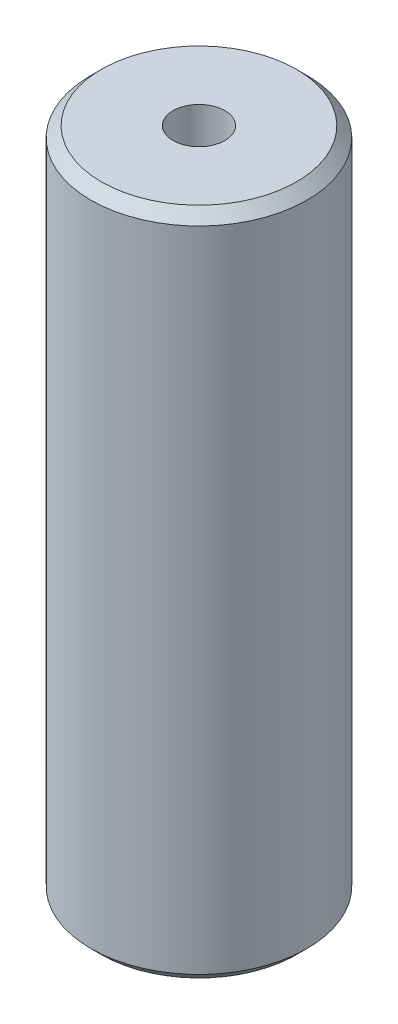
ISO-10303-21;
HEADER;
FILE_DESCRIPTION(('STEP AP214'),'2;1');
FILE_NAME('part.step','',(''),(''),'','','');
FILE_SCHEMA(('AUTOMOTIVE_DESIGN { 1 0 10303 214 1 1 1 1 }'));
ENDSEC;
DATA;
#1=APPLICATION_CONTEXT('core data for automotive mechanical design processes');
#2=APPLICATION_PROTOCOL_DEFINITION('international standard','automotive_design',2000,#1);
#3=PRODUCT_CONTEXT('',#1,'mechanical');
#4=PRODUCT('Part','Part','',(#3));
#5=PRODUCT_RELATED_PRODUCT_CATEGORY('part','',(#4));
#6=PRODUCT_DEFINITION_FORMATION('','',#4);
#7=PRODUCT_DEFINITION_CONTEXT('part definition',#1,'design');
#8=PRODUCT_DEFINITION('design','',#6,#7);
#9=PRODUCT_DEFINITION_SHAPE('','',#8);
#10=(LENGTH_UNIT() NAMED_UNIT(*) SI_UNIT(.MILLI.,.METRE.));
#11=(NAMED_UNIT(*) PLANE_ANGLE_UNIT() SI_UNIT($,.RADIAN.));
#12=(NAMED_UNIT(*) SI_UNIT($,.STERADIAN.) SOLID_ANGLE_UNIT());
#13=UNCERTAINTY_MEASURE_WITH_UNIT(LENGTH_MEASURE(1.E-05),#10,'distance_accuracy_value','');
#14=(GEOMETRIC_REPRESENTATION_CONTEXT(3) GLOBAL_UNCERTAINTY_ASSIGNED_CONTEXT((#13)) GLOBAL_UNIT_ASSIGNED_CONTEXT((#10,
#11,#12)) REPRESENTATION_CONTEXT('',''));
#15=CARTESIAN_POINT('',(0.,0.,0.));
#16=DIRECTION('',(0.,0.,1.));
#17=DIRECTION('',(1.,0.,0.));
#18=AXIS2_PLACEMENT_3D('',#15,#16,#17);
#19=CARTESIAN_POINT('',(0.,46.4443648281025,0.));
#20=DIRECTION('',(0.,-1.,0.));
#21=DIRECTION('',(0.,0.,-1.));
#22=AXIS2_PLACEMENT_3D('',#19,#20,#21);
#23=CYLINDRICAL_SURFACE('',#22,7.5);
#24=CARTESIAN_POINT('',(0.,45.711499699538,0.));
#25=DIRECTION('',(0.,1.,0.));
#26=DIRECTION('',(0.,0.,1.));
#27=AXIS2_PLACEMENT_3D('',#24,#25,#26);
#28=CIRCLE('',#27,7.5);
#29=CARTESIAN_POINT('',(0.,45.711499699538,7.5));
#30=VERTEX_POINT('',#29);
#31=EDGE_CURVE('E50',#30,#30,#28,.F.);
#32=ORIENTED_EDGE('',*,*,#31,.T.);
#33=EDGE_LOOP('',(#32));
#34=FACE_BOUND('',#33,.T.);
#35=CARTESIAN_POINT('',(0.,0.732865128564436,0.));
#36=DIRECTION('',(0.,1.,0.));
#37=DIRECTION('',(0.,0.,1.));
#38=AXIS2_PLACEMENT_3D('',#35,#36,#37);
#39=CIRCLE('',#38,7.5);
#40=CARTESIAN_POINT('',(0.,0.732865128564436,7.5));
#41=VERTEX_POINT('',#40);
#42=EDGE_CURVE('E51',#41,#41,#39,.T.);
#43=ORIENTED_EDGE('',*,*,#42,.T.);
#44=EDGE_LOOP('',(#43));
#45=FACE_BOUND('',#44,.T.);
#46=ADVANCED_FACE('F39',(#34,#45),#23,.T.);
#47=CARTESIAN_POINT('',(0.,46.4443648281025,0.));
#48=DIRECTION('',(0.,1.,0.));
#49=DIRECTION('',(0.,0.,1.));
#50=AXIS2_PLACEMENT_3D('',#47,#48,#49);
#51=PLANE('',#50);
#52=CARTESIAN_POINT('',(0.,46.4443648281025,0.));
#53=DIRECTION('',(0.,1.,0.));
#54=DIRECTION('',(0.,0.,1.));
#55=AXIS2_PLACEMENT_3D('',#52,#53,#54);
#56=CIRCLE('',#55,6.76713487143556);
#57=CARTESIAN_POINT('',(0.,46.4443648281025,6.76713487143556));
#58=VERTEX_POINT('',#57);
#59=EDGE_CURVE('E54',#58,#58,#56,.T.);
#60=ORIENTED_EDGE('',*,*,#59,.T.);
#61=EDGE_LOOP('',(#60));
#62=FACE_BOUND('',#61,.T.);
#63=CARTESIAN_POINT('',(0.,46.4443648281025,0.));
#64=DIRECTION('',(0.,1.,0.));
#65=DIRECTION('',(0.,0.,1.));
#66=AXIS2_PLACEMENT_3D('',#63,#64,#65);
#67=CIRCLE('',#66,1.79950106314135);
#68=CARTESIAN_POINT('',(0.,46.4443648281025,1.79950106314135));
#69=VERTEX_POINT('',#68);
#70=EDGE_CURVE('E58',#69,#69,#67,.T.);
#71=ORIENTED_EDGE('',*,*,#70,.F.);
#72=EDGE_LOOP('',(#71));
#73=FACE_BOUND('',#72,.T.);
#74=ADVANCED_FACE('F69',(#62,#73),#51,.T.);
#75=CARTESIAN_POINT('',(0.,0.,0.));
#76=DIRECTION('',(0.,1.,0.));
#77=DIRECTION('',(0.,0.,1.));
#78=AXIS2_PLACEMENT_3D('',#75,#76,#77);
#79=PLANE('',#78);
#80=CARTESIAN_POINT('',(0.,0.,0.));
#81=DIRECTION('',(0.,1.,0.));
#82=DIRECTION('',(0.,0.,1.));
#83=AXIS2_PLACEMENT_3D('',#80,#81,#82);
#84=CIRCLE('',#83,6.76713487143556);
#85=CARTESIAN_POINT('',(0.,0.,6.76713487143556));
#86=VERTEX_POINT('',#85);
#87=EDGE_CURVE('E10',#86,#86,#84,.F.);
#88=ORIENTED_EDGE('',*,*,#87,.T.);
#89=EDGE_LOOP('',(#88));
#90=FACE_BOUND('',#89,.T.);
#91=CARTESIAN_POINT('',(0.,0.,0.));
#92=DIRECTION('',(0.,1.,0.));
#93=DIRECTION('',(0.,0.,1.));
#94=AXIS2_PLACEMENT_3D('',#91,#92,#93);
#95=CIRCLE('',#94,1.79950106314135);
#96=CARTESIAN_POINT('',(0.,0.,1.79950106314135));
#97=VERTEX_POINT('',#96);
#98=EDGE_CURVE('E63',#97,#97,#95,.T.);
#99=ORIENTED_EDGE('',*,*,#98,.T.);
#100=EDGE_LOOP('',(#99));
#101=FACE_BOUND('',#100,.T.);
#102=ADVANCED_FACE('F75',(#90,#101),#79,.F.);
#103=CARTESIAN_POINT('',(0.,46.4443648281025,0.));
#104=DIRECTION('',(0.,-1.,0.));
#105=DIRECTION('',(0.,0.,-1.));
#106=AXIS2_PLACEMENT_3D('',#103,#104,#105);
#107=CYLINDRICAL_SURFACE('',#106,1.79950106314135);
#108=ORIENTED_EDGE('',*,*,#70,.T.);
#109=EDGE_LOOP('',(#108));
#110=FACE_BOUND('',#109,.T.);
#111=ORIENTED_EDGE('',*,*,#98,.F.);
#112=EDGE_LOOP('',(#111));
#113=FACE_BOUND('',#112,.T.);
#114=ADVANCED_FACE('F70',(#110,#113),#107,.F.);
#115=CARTESIAN_POINT('',(0.,46.4443648281025,0.));
#116=DIRECTION('',(0.,-1.,0.));
#117=DIRECTION('',(0.,0.,-1.));
#118=AXIS2_PLACEMENT_3D('',#115,#116,#117);
#119=CONICAL_SURFACE('',#118,6.76713487143556,0.785398163397444);
#120=ORIENTED_EDGE('',*,*,#31,.F.);
#121=EDGE_LOOP('',(#120));
#122=FACE_BOUND('',#121,.T.);
#123=ORIENTED_EDGE('',*,*,#59,.F.);
#124=EDGE_LOOP('',(#123));
#125=FACE_BOUND('',#124,.T.);
#126=ADVANCED_FACE('F81',(#122,#125),#119,.T.);
#127=CARTESIAN_POINT('',(0.,0.732865128564436,0.));
#128=DIRECTION('',(0.,1.,0.));
#129=DIRECTION('',(0.,0.,1.));
#130=AXIS2_PLACEMENT_3D('',#127,#128,#129);
#131=CONICAL_SURFACE('',#130,7.5,0.785398163397448);
#132=CARTESIAN_POINT('',(0.,0.,6.76713487143556));
#133=CARTESIAN_POINT('',(0.,0.00763401175587944,6.77476888319144));
#134=CARTESIAN_POINT('',(0.,0.015268023511759,6.78240289494732));
#135=CARTESIAN_POINT('',(0.,0.0305360470235181,6.79767091845908));
#136=CARTESIAN_POINT('',(0.,0.0381700587793976,6.80530493021496));
#137=CARTESIAN_POINT('',(0.,0.0534380822911567,6.82057295372672));
#138=CARTESIAN_POINT('',(0.,0.0610720940470362,6.8282069654826));
#139=CARTESIAN_POINT('',(0.,0.0763401175587953,6.84347498899436));
#140=CARTESIAN_POINT('',(0.,0.0839741293146749,6.85110900075024));
#141=CARTESIAN_POINT('',(0.,0.0992421528264339,6.866377024262));
#142=CARTESIAN_POINT('',(0.,0.106876164582313,6.87401103601788));
#143=CARTESIAN_POINT('',(0.,0.122144188094073,6.88927905952964));
#144=CARTESIAN_POINT('',(0.,0.129778199849952,6.89691307128552));
#145=CARTESIAN_POINT('',(0.,0.145046223361711,6.91218109479728));
#146=CARTESIAN_POINT('',(0.,0.152680235117591,6.91981510655315));
#147=CARTESIAN_POINT('',(0.,0.16794825862935,6.93508313006491));
#148=CARTESIAN_POINT('',(0.,0.175582270385229,6.94271714182079));
#149=CARTESIAN_POINT('',(0.,0.190850293896988,6.95798516533255));
#150=CARTESIAN_POINT('',(0.,0.198484305652868,6.96561917708843));
#151=CARTESIAN_POINT('',(0.,0.213752329164627,6.98088720060019));
#152=CARTESIAN_POINT('',(0.,0.221386340920507,6.98852121235607));
#153=CARTESIAN_POINT('',(0.,0.236654364432266,7.00378923586783));
#154=CARTESIAN_POINT('',(0.,0.244288376188145,7.01142324762371));
#155=CARTESIAN_POINT('',(0.,0.259556399699904,7.02669127113547));
#156=CARTESIAN_POINT('',(0.,0.267190411455784,7.03432528289135));
#157=CARTESIAN_POINT('',(0.,0.282458434967543,7.04959330640311));
#158=CARTESIAN_POINT('',(0.,0.290092446723422,7.05722731815899));
#159=CARTESIAN_POINT('',(0.,0.305360470235182,7.07249534167075));
#160=CARTESIAN_POINT('',(0.,0.312994481991061,7.08012935342663));
#161=CARTESIAN_POINT('',(0.,0.32826250550282,7.09539737693838));
#162=CARTESIAN_POINT('',(0.,0.3358965172587,7.10303138869426));
#163=CARTESIAN_POINT('',(0.,0.351164540770459,7.11829941220602));
#164=CARTESIAN_POINT('',(0.,0.358798552526338,7.1259334239619));
#165=CARTESIAN_POINT('',(0.,0.374066576038097,7.14120144747366));
#166=CARTESIAN_POINT('',(0.,0.381700587793977,7.14883545922954));
#167=CARTESIAN_POINT('',(0.,0.396968611305736,7.1641034827413));
#168=CARTESIAN_POINT('',(0.,0.404602623061616,7.17173749449718));
#169=CARTESIAN_POINT('',(0.,0.419870646573375,7.18700551800894));
#170=CARTESIAN_POINT('',(0.,0.427504658329254,7.19463952976482));
#171=CARTESIAN_POINT('',(0.,0.442772681841013,7.20990755327658));
#172=CARTESIAN_POINT('',(0.,0.450406693596893,7.21754156503246));
#173=CARTESIAN_POINT('',(0.,0.465674717108652,7.23280958854422));
#174=CARTESIAN_POINT('',(0.,0.473308728864532,7.24044360030009));
#175=CARTESIAN_POINT('',(0.,0.488576752376291,7.25571162381185));
#176=CARTESIAN_POINT('',(0.,0.49621076413217,7.26334563556773));
#177=CARTESIAN_POINT('',(0.,0.511478787643929,7.27861365907949));
#178=CARTESIAN_POINT('',(0.,0.519112799399809,7.28624767083537));
#179=CARTESIAN_POINT('',(0.,0.534380822911568,7.30151569434713));
#180=CARTESIAN_POINT('',(0.,0.542014834667447,7.30914970610301));
#181=CARTESIAN_POINT('',(0.,0.557282858179207,7.32441772961477));
#182=CARTESIAN_POINT('',(0.,0.564916869935086,7.33205174137065));
#183=CARTESIAN_POINT('',(0.,0.580184893446845,7.34731976488241));
#184=CARTESIAN_POINT('',(0.,0.587818905202725,7.35495377663829));
#185=CARTESIAN_POINT('',(0.,0.603086928714484,7.37022180015005));
#186=CARTESIAN_POINT('',(0.,0.610720940470363,7.37785581190593));
#187=CARTESIAN_POINT('',(0.,0.625988963982122,7.39312383541769));
#188=CARTESIAN_POINT('',(0.,0.633622975738002,7.40075784717357));
#189=CARTESIAN_POINT('',(0.,0.648890999249761,7.41602587068533));
#190=CARTESIAN_POINT('',(0.,0.656525011005641,7.4236598824412));
#191=CARTESIAN_POINT('',(0.,0.6717930345174,7.43892790595296));
#192=CARTESIAN_POINT('',(0.,0.679427046273279,7.44656191770884));
#193=CARTESIAN_POINT('',(0.,0.694695069785038,7.4618299412206));
#194=CARTESIAN_POINT('',(0.,0.702329081540918,7.46946395297648));
#195=CARTESIAN_POINT('',(0.,0.717597105052677,7.48473197648824));
#196=CARTESIAN_POINT('',(0.,0.725231116808556,7.49236598824412));
#197=CARTESIAN_POINT('',(0.,0.732865128564436,7.5));
#198=B_SPLINE_CURVE_WITH_KNOTS('',3,(#132,#133,#134,#135,#136,#137,#138,#139,#140,#141,#142,
#143,#144,#145,#146,#147,#148,#149,#150,#151,#152,#153,#154,#155,#156,#157,#158,#159,#160,#161,
#162,#163,#164,#165,#166,#167,#168,#169,#170,#171,#172,#173,#174,#175,#176,#177,#178,#179,#180,
#181,#182,#183,#184,#185,#186,#187,#188,#189,#190,#191,#192,#193,#194,#195,#196,#197),
.UNSPECIFIED.,.F.,.F.,(4,2,2,2,2,2,2,2,2,2,2,2,2,2,2,2,2,2,2,2,2,2,2,2,2,2,2,2,2,2,2,2,4),(0.,
0.0323883688814415,0.064776737762883,0.0971651066443244,0.129553475525766,0.161941844407207,
0.194330213288649,0.22671858217009,0.259106951051532,0.291495319932973,0.323883688814415,
0.356272057695856,0.388660426577298,0.421048795458739,0.453437164340181,0.485825533221622,
0.518213902103064,0.550602270984505,0.582990639865947,0.615379008747388,0.64776737762883,
0.680155746510271,0.712544115391713,0.744932484273155,0.777320853154596,0.809709222036037,
0.842097590917479,0.874485959798921,0.906874328680362,0.939262697561803,0.971651066443245,
1.00403943532469,1.03642780420613),.UNSPECIFIED.);
#199=EDGE_CURVE('BSEAM45',#86,#41,#198,.T.);
#200=ORIENTED_EDGE('',*,*,#87,.F.);
#201=ORIENTED_EDGE('',*,*,#42,.F.);
#202=ORIENTED_EDGE('',*,*,#199,.T.);
#203=ORIENTED_EDGE('',*,*,#199,.F.);
#204=EDGE_LOOP('',(#200,#202,#201,#203));
#205=FACE_BOUND('',#204,.T.);
#206=ADVANCED_FACE('F45',(#205),#131,.T.);
#207=CLOSED_SHELL('',(#46,#74,#102,#114,#126,#206));
#208=MANIFOLD_SOLID_BREP('B2',#207);
#209=ADVANCED_BREP_SHAPE_REPRESENTATION('',(#18,#208),#14);
#210=SHAPE_DEFINITION_REPRESENTATION(#9,#209);
ENDSEC;
END-ISO-10303-21;
